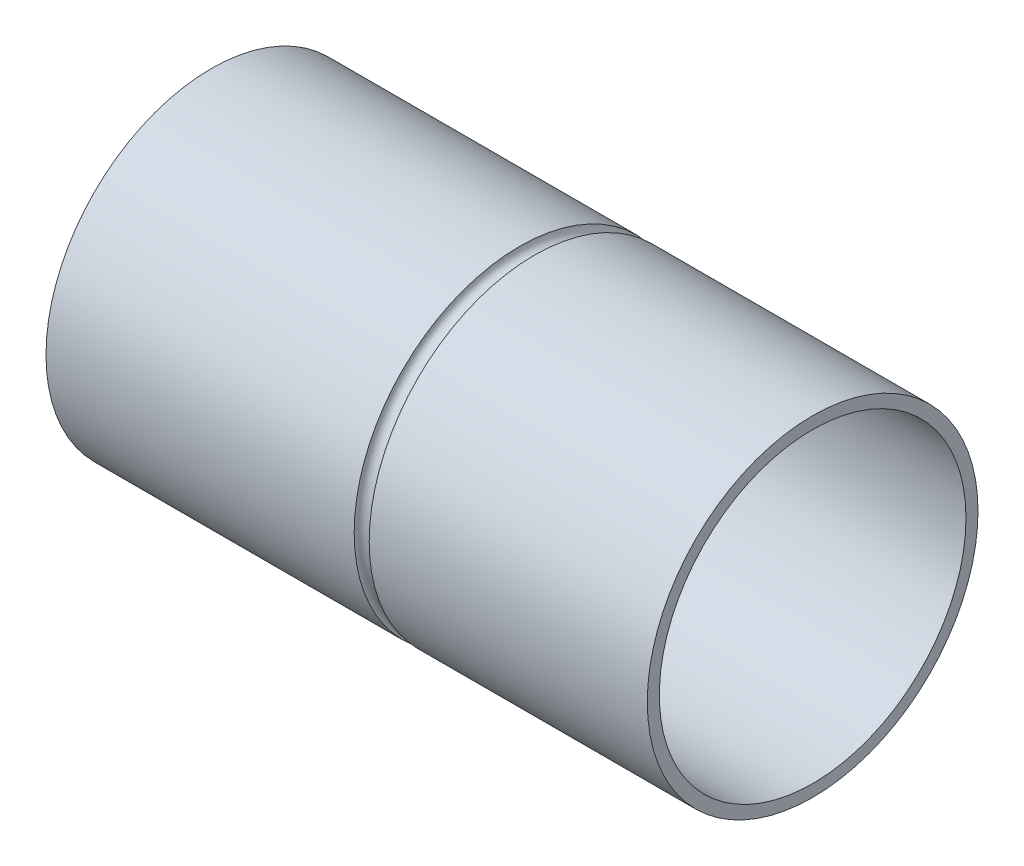
ISO-10303-21;
HEADER;
FILE_DESCRIPTION(('STEP AP214'),'2;1');
FILE_NAME('part.step','',(''),(''),'','','');
FILE_SCHEMA(('AUTOMOTIVE_DESIGN { 1 0 10303 214 1 1 1 1 }'));
ENDSEC;
DATA;
#1=APPLICATION_CONTEXT('core data for automotive mechanical design processes');
#2=APPLICATION_PROTOCOL_DEFINITION('international standard','automotive_design',2000,#1);
#3=PRODUCT_CONTEXT('',#1,'mechanical');
#4=PRODUCT('Part','Part','',(#3));
#5=PRODUCT_RELATED_PRODUCT_CATEGORY('part','',(#4));
#6=PRODUCT_DEFINITION_FORMATION('','',#4);
#7=PRODUCT_DEFINITION_CONTEXT('part definition',#1,'design');
#8=PRODUCT_DEFINITION('design','',#6,#7);
#9=PRODUCT_DEFINITION_SHAPE('','',#8);
#10=(LENGTH_UNIT() NAMED_UNIT(*) SI_UNIT(.MILLI.,.METRE.));
#11=(NAMED_UNIT(*) PLANE_ANGLE_UNIT() SI_UNIT($,.RADIAN.));
#12=(NAMED_UNIT(*) SI_UNIT($,.STERADIAN.) SOLID_ANGLE_UNIT());
#13=UNCERTAINTY_MEASURE_WITH_UNIT(LENGTH_MEASURE(1.E-05),#10,'distance_accuracy_value','');
#14=(GEOMETRIC_REPRESENTATION_CONTEXT(3) GLOBAL_UNCERTAINTY_ASSIGNED_CONTEXT((#13)) GLOBAL_UNIT_ASSIGNED_CONTEXT((#10,
#11,#12)) REPRESENTATION_CONTEXT('',''));
#15=CARTESIAN_POINT('',(0.,0.,0.));
#16=DIRECTION('',(0.,0.,1.));
#17=DIRECTION('',(1.,0.,0.));
#18=AXIS2_PLACEMENT_3D('',#15,#16,#17);
#19=CARTESIAN_POINT('',(200.,0.,0.));
#20=DIRECTION('',(-1.,0.,0.));
#21=DIRECTION('',(0.,0.,1.));
#22=AXIS2_PLACEMENT_3D('',#19,#20,#21);
#23=CYLINDRICAL_SURFACE('',#22,55.);
#24=CARTESIAN_POINT('',(107.5,0.,0.));
#25=DIRECTION('',(-1.,0.,0.));
#26=DIRECTION('',(0.,0.,1.));
#27=AXIS2_PLACEMENT_3D('',#24,#25,#26);
#28=CIRCLE('',#27,55.);
#29=CARTESIAN_POINT('',(107.5,0.,-55.));
#30=VERTEX_POINT('',#29);
#31=EDGE_CURVE('E12',#30,#30,#28,.F.);
#32=ORIENTED_EDGE('',*,*,#31,.T.);
#33=EDGE_LOOP('',(#32));
#34=FACE_BOUND('',#33,.T.);
#35=CARTESIAN_POINT('',(200.,0.,0.));
#36=DIRECTION('',(1.,0.,0.));
#37=DIRECTION('',(0.,0.,-1.));
#38=AXIS2_PLACEMENT_3D('',#35,#36,#37);
#39=CIRCLE('',#38,55.);
#40=CARTESIAN_POINT('',(200.,0.,-55.));
#41=VERTEX_POINT('',#40);
#42=EDGE_CURVE('E106',#41,#41,#39,.T.);
#43=ORIENTED_EDGE('',*,*,#42,.F.);
#44=EDGE_LOOP('',(#43));
#45=FACE_BOUND('',#44,.T.);
#46=ADVANCED_FACE('F52',(#34,#45),#23,.T.);
#47=CARTESIAN_POINT('',(200.,0.,0.));
#48=DIRECTION('',(-1.,0.,0.));
#49=DIRECTION('',(0.,0.,1.));
#50=AXIS2_PLACEMENT_3D('',#47,#48,#49);
#51=CYLINDRICAL_SURFACE('',#50,19.);
#52=CARTESIAN_POINT('',(10.,0.,0.));
#53=DIRECTION('',(1.,0.,0.));
#54=DIRECTION('',(0.,0.,-1.));
#55=AXIS2_PLACEMENT_3D('',#52,#53,#54);
#56=CIRCLE('',#55,19.);
#57=CARTESIAN_POINT('',(10.,0.,-19.));
#58=VERTEX_POINT('',#57);
#59=EDGE_CURVE('E89',#58,#58,#56,.T.);
#60=ORIENTED_EDGE('',*,*,#59,.T.);
#61=EDGE_LOOP('',(#60));
#62=FACE_BOUND('',#61,.T.);
#63=CARTESIAN_POINT('',(2.,0.,0.));
#64=DIRECTION('',(-1.,0.,0.));
#65=DIRECTION('',(0.,0.,1.));
#66=AXIS2_PLACEMENT_3D('',#63,#64,#65);
#67=CIRCLE('',#66,19.);
#68=CARTESIAN_POINT('',(2.,0.,19.));
#69=VERTEX_POINT('',#68);
#70=EDGE_CURVE('E84',#69,#69,#67,.F.);
#71=ORIENTED_EDGE('',*,*,#70,.F.);
#72=EDGE_LOOP('',(#71));
#73=FACE_BOUND('',#72,.T.);
#74=ADVANCED_FACE('F118',(#62,#73),#51,.F.);
#75=CARTESIAN_POINT('',(102.5,0.,0.));
#76=DIRECTION('',(1.,0.,0.));
#77=DIRECTION('',(0.,0.,-1.));
#78=AXIS2_PLACEMENT_3D('',#75,#76,#77);
#79=CIRCLE('',#78,55.);
#80=CARTESIAN_POINT('',(102.5,0.,-55.));
#81=VERTEX_POINT('',#80);
#82=EDGE_CURVE('E60',#81,#81,#79,.F.);
#83=ORIENTED_EDGE('',*,*,#82,.T.);
#84=EDGE_LOOP('',(#83));
#85=FACE_BOUND('',#84,.T.);
#86=CARTESIAN_POINT('',(0.,0.,0.));
#87=DIRECTION('',(1.,0.,0.));
#88=DIRECTION('',(0.,0.,-1.));
#89=AXIS2_PLACEMENT_3D('',#86,#87,#88);
#90=CIRCLE('',#89,55.);
#91=CARTESIAN_POINT('',(0.,0.,-55.));
#92=VERTEX_POINT('',#91);
#93=EDGE_CURVE('E102',#92,#92,#90,.T.);
#94=ORIENTED_EDGE('',*,*,#93,.T.);
#95=EDGE_LOOP('',(#94));
#96=FACE_BOUND('',#95,.T.);
#97=ADVANCED_FACE('F54',(#85,#96),#23,.T.);
#98=CARTESIAN_POINT('',(200.,0.,0.));
#99=DIRECTION('',(1.,0.,0.));
#100=DIRECTION('',(0.,0.,-1.));
#101=AXIS2_PLACEMENT_3D('',#98,#99,#100);
#102=PLANE('',#101);
#103=CARTESIAN_POINT('',(200.,0.,0.));
#104=DIRECTION('',(1.,0.,0.));
#105=DIRECTION('',(0.,0.,-1.));
#106=AXIS2_PLACEMENT_3D('',#103,#104,#105);
#107=CIRCLE('',#106,51.);
#108=CARTESIAN_POINT('',(200.,0.,-51.));
#109=VERTEX_POINT('',#108);
#110=EDGE_CURVE('E103',#109,#109,#107,.T.);
#111=ORIENTED_EDGE('',*,*,#110,.F.);
#112=EDGE_LOOP('',(#111));
#113=FACE_BOUND('',#112,.T.);
#114=ORIENTED_EDGE('',*,*,#42,.T.);
#115=EDGE_LOOP('',(#114));
#116=FACE_BOUND('',#115,.T.);
#117=ADVANCED_FACE('F117',(#113,#116),#102,.T.);
#118=CARTESIAN_POINT('',(0.,0.,0.));
#119=DIRECTION('',(1.,0.,0.));
#120=DIRECTION('',(0.,0.,-1.));
#121=AXIS2_PLACEMENT_3D('',#118,#119,#120);
#122=PLANE('',#121);
#123=CARTESIAN_POINT('',(0.,0.,0.));
#124=DIRECTION('',(-1.,0.,0.));
#125=DIRECTION('',(0.,0.,1.));
#126=AXIS2_PLACEMENT_3D('',#123,#124,#125);
#127=CIRCLE('',#126,22.5);
#128=CARTESIAN_POINT('',(0.,0.,22.5));
#129=VERTEX_POINT('',#128);
#130=EDGE_CURVE('E70',#129,#129,#127,.T.);
#131=ORIENTED_EDGE('',*,*,#130,.F.);
#132=EDGE_LOOP('',(#131));
#133=FACE_BOUND('',#132,.T.);
#134=CARTESIAN_POINT('',(0.,34.,0.));
#135=DIRECTION('',(-1.,0.,0.));
#136=DIRECTION('',(0.,0.,1.));
#137=AXIS2_PLACEMENT_3D('',#134,#135,#136);
#138=CIRCLE('',#137,5.);
#139=CARTESIAN_POINT('',(0.,34.,5.));
#140=VERTEX_POINT('',#139);
#141=EDGE_CURVE('E90',#140,#140,#138,.T.);
#142=ORIENTED_EDGE('',*,*,#141,.F.);
#143=EDGE_LOOP('',(#142));
#144=FACE_BOUND('',#143,.T.);
#145=CARTESIAN_POINT('',(0.,-34.,0.));
#146=DIRECTION('',(-1.,0.,0.));
#147=DIRECTION('',(0.,0.,1.));
#148=AXIS2_PLACEMENT_3D('',#145,#146,#147);
#149=CIRCLE('',#148,5.);
#150=CARTESIAN_POINT('',(0.,-34.,5.));
#151=VERTEX_POINT('',#150);
#152=EDGE_CURVE('E96',#151,#151,#149,.T.);
#153=ORIENTED_EDGE('',*,*,#152,.F.);
#154=EDGE_LOOP('',(#153));
#155=FACE_BOUND('',#154,.T.);
#156=ORIENTED_EDGE('',*,*,#93,.F.);
#157=EDGE_LOOP('',(#156));
#158=FACE_BOUND('',#157,.T.);
#159=ADVANCED_FACE('F121',(#133,#144,#155,#158),#122,.F.);
#160=CARTESIAN_POINT('',(10.,0.,0.));
#161=DIRECTION('',(1.,0.,0.));
#162=DIRECTION('',(0.,0.,-1.));
#163=AXIS2_PLACEMENT_3D('',#160,#161,#162);
#164=CYLINDRICAL_SURFACE('',#163,51.);
#165=CARTESIAN_POINT('',(10.,0.,0.));
#166=DIRECTION('',(1.,0.,0.));
#167=DIRECTION('',(0.,0.,-1.));
#168=AXIS2_PLACEMENT_3D('',#165,#166,#167);
#169=CIRCLE('',#168,51.);
#170=CARTESIAN_POINT('',(10.,0.,-51.));
#171=VERTEX_POINT('',#170);
#172=EDGE_CURVE('E99',#171,#171,#169,.T.);
#173=ORIENTED_EDGE('',*,*,#172,.F.);
#174=EDGE_LOOP('',(#173));
#175=FACE_BOUND('',#174,.T.);
#176=ORIENTED_EDGE('',*,*,#110,.T.);
#177=EDGE_LOOP('',(#176));
#178=FACE_BOUND('',#177,.T.);
#179=ADVANCED_FACE('F123',(#175,#178),#164,.F.);
#180=CARTESIAN_POINT('',(10.,0.,0.));
#181=DIRECTION('',(1.,0.,0.));
#182=DIRECTION('',(0.,0.,-1.));
#183=AXIS2_PLACEMENT_3D('',#180,#181,#182);
#184=PLANE('',#183);
#185=ORIENTED_EDGE('',*,*,#59,.F.);
#186=EDGE_LOOP('',(#185));
#187=FACE_BOUND('',#186,.T.);
#188=ORIENTED_EDGE('',*,*,#172,.T.);
#189=EDGE_LOOP('',(#188));
#190=FACE_BOUND('',#189,.T.);
#191=ADVANCED_FACE('F129',(#187,#190),#184,.T.);
#192=CARTESIAN_POINT('',(2.,-34.,0.));
#193=DIRECTION('',(-1.,0.,0.));
#194=DIRECTION('',(0.,0.,1.));
#195=AXIS2_PLACEMENT_3D('',#192,#193,#194);
#196=CYLINDRICAL_SURFACE('',#195,5.);
#197=CARTESIAN_POINT('',(2.,-34.,0.));
#198=DIRECTION('',(-1.,0.,0.));
#199=DIRECTION('',(0.,0.,1.));
#200=AXIS2_PLACEMENT_3D('',#197,#198,#199);
#201=CIRCLE('',#200,5.);
#202=CARTESIAN_POINT('',(2.,-34.,5.));
#203=VERTEX_POINT('',#202);
#204=EDGE_CURVE('E93',#203,#203,#201,.T.);
#205=ORIENTED_EDGE('',*,*,#204,.F.);
#206=EDGE_LOOP('',(#205));
#207=FACE_BOUND('',#206,.T.);
#208=ORIENTED_EDGE('',*,*,#152,.T.);
#209=EDGE_LOOP('',(#208));
#210=FACE_BOUND('',#209,.T.);
#211=ADVANCED_FACE('F151',(#207,#210),#196,.F.);
#212=CARTESIAN_POINT('',(2.,-34.,0.));
#213=DIRECTION('',(-1.,0.,0.));
#214=DIRECTION('',(0.,0.,1.));
#215=AXIS2_PLACEMENT_3D('',#212,#213,#214);
#216=PLANE('',#215);
#217=CARTESIAN_POINT('',(2.,-34.,0.));
#218=DIRECTION('',(-1.,0.,0.));
#219=DIRECTION('',(0.,0.,1.));
#220=AXIS2_PLACEMENT_3D('',#217,#218,#219);
#221=CIRCLE('',#220,2.5);
#222=CARTESIAN_POINT('',(2.,-34.,2.5));
#223=VERTEX_POINT('',#222);
#224=EDGE_CURVE('E217',#223,#223,#221,.T.);
#225=ORIENTED_EDGE('',*,*,#224,.F.);
#226=EDGE_LOOP('',(#225));
#227=FACE_BOUND('',#226,.T.);
#228=ORIENTED_EDGE('',*,*,#204,.T.);
#229=EDGE_LOOP('',(#228));
#230=FACE_BOUND('',#229,.T.);
#231=ADVANCED_FACE('F158',(#227,#230),#216,.T.);
#232=CARTESIAN_POINT('',(2.,34.,0.));
#233=DIRECTION('',(-1.,0.,0.));
#234=DIRECTION('',(0.,0.,1.));
#235=AXIS2_PLACEMENT_3D('',#232,#233,#234);
#236=CYLINDRICAL_SURFACE('',#235,5.);
#237=CARTESIAN_POINT('',(2.,34.,0.));
#238=DIRECTION('',(-1.,0.,0.));
#239=DIRECTION('',(0.,0.,1.));
#240=AXIS2_PLACEMENT_3D('',#237,#238,#239);
#241=CIRCLE('',#240,5.);
#242=CARTESIAN_POINT('',(2.,34.,5.));
#243=VERTEX_POINT('',#242);
#244=EDGE_CURVE('E86',#243,#243,#241,.T.);
#245=ORIENTED_EDGE('',*,*,#244,.F.);
#246=EDGE_LOOP('',(#245));
#247=FACE_BOUND('',#246,.T.);
#248=ORIENTED_EDGE('',*,*,#141,.T.);
#249=EDGE_LOOP('',(#248));
#250=FACE_BOUND('',#249,.T.);
#251=ADVANCED_FACE('F168',(#247,#250),#236,.F.);
#252=CARTESIAN_POINT('',(2.,34.,0.));
#253=DIRECTION('',(-1.,0.,0.));
#254=DIRECTION('',(0.,0.,1.));
#255=AXIS2_PLACEMENT_3D('',#252,#253,#254);
#256=PLANE('',#255);
#257=CARTESIAN_POINT('',(2.,34.,0.));
#258=DIRECTION('',(-1.,0.,0.));
#259=DIRECTION('',(0.,0.,1.));
#260=AXIS2_PLACEMENT_3D('',#257,#258,#259);
#261=CIRCLE('',#260,2.5);
#262=CARTESIAN_POINT('',(2.,34.,2.5));
#263=VERTEX_POINT('',#262);
#264=EDGE_CURVE('E77',#263,#263,#261,.T.);
#265=ORIENTED_EDGE('',*,*,#264,.F.);
#266=EDGE_LOOP('',(#265));
#267=FACE_BOUND('',#266,.T.);
#268=ORIENTED_EDGE('',*,*,#244,.T.);
#269=EDGE_LOOP('',(#268));
#270=FACE_BOUND('',#269,.T.);
#271=ADVANCED_FACE('F178',(#267,#270),#256,.T.);
#272=CARTESIAN_POINT('',(2.,0.,0.));
#273=DIRECTION('',(-1.,0.,0.));
#274=DIRECTION('',(0.,0.,1.));
#275=AXIS2_PLACEMENT_3D('',#272,#273,#274);
#276=PLANE('',#275);
#277=CARTESIAN_POINT('',(2.,0.,0.));
#278=DIRECTION('',(-1.,0.,0.));
#279=DIRECTION('',(0.,0.,1.));
#280=AXIS2_PLACEMENT_3D('',#277,#278,#279);
#281=CIRCLE('',#280,22.5);
#282=CARTESIAN_POINT('',(2.,0.,22.5));
#283=VERTEX_POINT('',#282);
#284=EDGE_CURVE('E74',#283,#283,#281,.T.);
#285=ORIENTED_EDGE('',*,*,#284,.T.);
#286=EDGE_LOOP('',(#285));
#287=FACE_BOUND('',#286,.T.);
#288=ORIENTED_EDGE('',*,*,#70,.T.);
#289=EDGE_LOOP('',(#288));
#290=FACE_BOUND('',#289,.T.);
#291=ADVANCED_FACE('F185',(#287,#290),#276,.T.);
#292=CARTESIAN_POINT('',(2.,0.,0.));
#293=DIRECTION('',(-1.,0.,0.));
#294=DIRECTION('',(0.,0.,1.));
#295=AXIS2_PLACEMENT_3D('',#292,#293,#294);
#296=CYLINDRICAL_SURFACE('',#295,22.5);
#297=ORIENTED_EDGE('',*,*,#284,.F.);
#298=EDGE_LOOP('',(#297));
#299=FACE_BOUND('',#298,.T.);
#300=ORIENTED_EDGE('',*,*,#130,.T.);
#301=EDGE_LOOP('',(#300));
#302=FACE_BOUND('',#301,.T.);
#303=ADVANCED_FACE('F187',(#299,#302),#296,.F.);
#304=CARTESIAN_POINT('',(105.,0.,0.));
#305=DIRECTION('',(1.,0.,0.));
#306=DIRECTION('',(0.,0.,-1.));
#307=AXIS2_PLACEMENT_3D('',#304,#305,#306);
#308=TOROIDAL_SURFACE('',#307,55.,2.5);
#309=CARTESIAN_POINT('',(105.,0.,-55.));
#310=DIRECTION('',(0.,1.,0.));
#311=DIRECTION('',(-1.,0.,0.));
#312=AXIS2_PLACEMENT_3D('',#309,#310,#311);
#313=CIRCLE('',#312,2.5);
#314=EDGE_CURVE('E67',#81,#30,#313,.T.);
#315=ORIENTED_EDGE('',*,*,#314,.F.);
#316=ORIENTED_EDGE('',*,*,#82,.F.);
#317=ORIENTED_EDGE('',*,*,#314,.T.);
#318=ORIENTED_EDGE('',*,*,#31,.F.);
#319=EDGE_LOOP('',(#315,#316,#317,#318));
#320=FACE_BOUND('',#319,.T.);
#321=ADVANCED_FACE('F68',(#320),#308,.F.);
#322=CARTESIAN_POINT('',(4.,34.,0.));
#323=DIRECTION('',(-1.,0.,0.));
#324=DIRECTION('',(0.,0.,1.));
#325=AXIS2_PLACEMENT_3D('',#322,#323,#324);
#326=CYLINDRICAL_SURFACE('',#325,2.5);
#327=CARTESIAN_POINT('',(4.,34.,0.));
#328=DIRECTION('',(-1.,0.,0.));
#329=DIRECTION('',(0.,0.,1.));
#330=AXIS2_PLACEMENT_3D('',#327,#328,#329);
#331=CIRCLE('',#330,2.5);
#332=CARTESIAN_POINT('',(4.,34.,2.5));
#333=VERTEX_POINT('',#332);
#334=EDGE_CURVE('E71',#333,#333,#331,.T.);
#335=ORIENTED_EDGE('',*,*,#334,.F.);
#336=EDGE_LOOP('',(#335));
#337=FACE_BOUND('',#336,.T.);
#338=ORIENTED_EDGE('',*,*,#264,.T.);
#339=EDGE_LOOP('',(#338));
#340=FACE_BOUND('',#339,.T.);
#341=ADVANCED_FACE('F196',(#337,#340),#326,.F.);
#342=CARTESIAN_POINT('',(4.,34.,0.));
#343=DIRECTION('',(-1.,0.,0.));
#344=DIRECTION('',(0.,0.,1.));
#345=AXIS2_PLACEMENT_3D('',#342,#343,#344);
#346=PLANE('',#345);
#347=ORIENTED_EDGE('',*,*,#334,.T.);
#348=EDGE_LOOP('',(#347));
#349=FACE_BOUND('',#348,.T.);
#350=ADVANCED_FACE('F204',(#349),#346,.T.);
#351=CARTESIAN_POINT('',(4.,-34.,0.));
#352=DIRECTION('',(-1.,0.,0.));
#353=DIRECTION('',(0.,0.,1.));
#354=AXIS2_PLACEMENT_3D('',#351,#352,#353);
#355=CYLINDRICAL_SURFACE('',#354,2.5);
#356=CARTESIAN_POINT('',(4.,-34.,0.));
#357=DIRECTION('',(-1.,0.,0.));
#358=DIRECTION('',(0.,0.,1.));
#359=AXIS2_PLACEMENT_3D('',#356,#357,#358);
#360=CIRCLE('',#359,2.5);
#361=CARTESIAN_POINT('',(4.,-34.,2.5));
#362=VERTEX_POINT('',#361);
#363=EDGE_CURVE('E81',#362,#362,#360,.T.);
#364=ORIENTED_EDGE('',*,*,#363,.F.);
#365=EDGE_LOOP('',(#364));
#366=FACE_BOUND('',#365,.T.);
#367=ORIENTED_EDGE('',*,*,#224,.T.);
#368=EDGE_LOOP('',(#367));
#369=FACE_BOUND('',#368,.T.);
#370=ADVANCED_FACE('F200',(#366,#369),#355,.F.);
#371=CARTESIAN_POINT('',(4.,-34.,0.));
#372=DIRECTION('',(-1.,0.,0.));
#373=DIRECTION('',(0.,0.,1.));
#374=AXIS2_PLACEMENT_3D('',#371,#372,#373);
#375=PLANE('',#374);
#376=ORIENTED_EDGE('',*,*,#363,.T.);
#377=EDGE_LOOP('',(#376));
#378=FACE_BOUND('',#377,.T.);
#379=ADVANCED_FACE('F197',(#378),#375,.T.);
#380=CLOSED_SHELL('',(#46,#74,#97,#117,#159,#179,#191,#211,#231,#251,#271,#291,#303,#321,#341,
#350,#370,#379));
#381=MANIFOLD_SOLID_BREP('B2',#380);
#382=ADVANCED_BREP_SHAPE_REPRESENTATION('',(#18,#381),#14);
#383=SHAPE_DEFINITION_REPRESENTATION(#9,#382);
ENDSEC;
END-ISO-10303-21;
